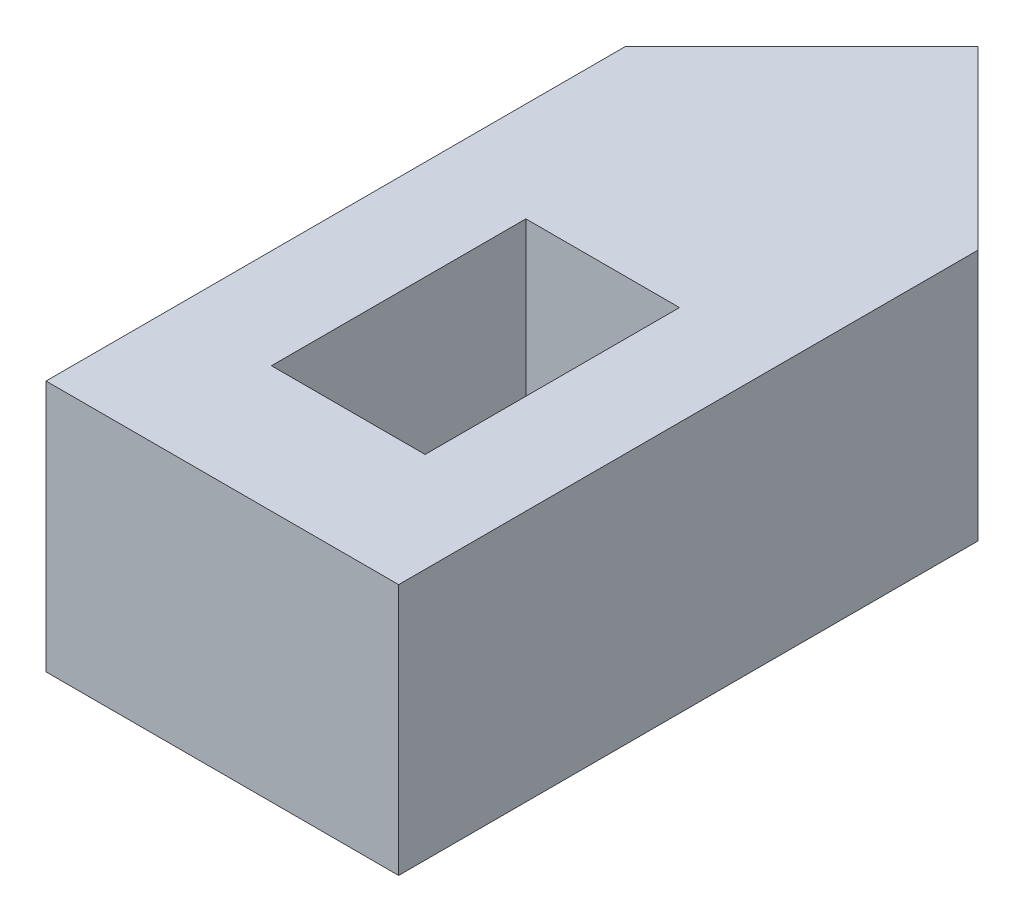
ISO-10303-21;
HEADER;
FILE_DESCRIPTION(('STEP AP214'),'2;1');
FILE_NAME('part.step','',(''),(''),'','','');
FILE_SCHEMA(('AUTOMOTIVE_DESIGN { 1 0 10303 214 1 1 1 1 }'));
ENDSEC;
DATA;
#1=APPLICATION_CONTEXT('core data for automotive mechanical design processes');
#2=APPLICATION_PROTOCOL_DEFINITION('international standard','automotive_design',2000,#1);
#3=PRODUCT_CONTEXT('',#1,'mechanical');
#4=PRODUCT('Part','Part','',(#3));
#5=PRODUCT_RELATED_PRODUCT_CATEGORY('part','',(#4));
#6=PRODUCT_DEFINITION_FORMATION('','',#4);
#7=PRODUCT_DEFINITION_CONTEXT('part definition',#1,'design');
#8=PRODUCT_DEFINITION('design','',#6,#7);
#9=PRODUCT_DEFINITION_SHAPE('','',#8);
#10=(LENGTH_UNIT() NAMED_UNIT(*) SI_UNIT(.MILLI.,.METRE.));
#11=(NAMED_UNIT(*) PLANE_ANGLE_UNIT() SI_UNIT($,.RADIAN.));
#12=(NAMED_UNIT(*) SI_UNIT($,.STERADIAN.) SOLID_ANGLE_UNIT());
#13=UNCERTAINTY_MEASURE_WITH_UNIT(LENGTH_MEASURE(1.E-05),#10,'distance_accuracy_value','');
#14=(GEOMETRIC_REPRESENTATION_CONTEXT(3) GLOBAL_UNCERTAINTY_ASSIGNED_CONTEXT((#13)) GLOBAL_UNIT_ASSIGNED_CONTEXT((#10,
#11,#12)) REPRESENTATION_CONTEXT('',''));
#15=CARTESIAN_POINT('',(0.,0.,0.));
#16=DIRECTION('',(0.,0.,1.));
#17=DIRECTION('',(1.,0.,0.));
#18=AXIS2_PLACEMENT_3D('',#15,#16,#17);
#19=CARTESIAN_POINT('',(0.,5.,0.));
#20=DIRECTION('',(0.,-1.,0.));
#21=DIRECTION('',(0.,0.,-1.));
#22=AXIS2_PLACEMENT_3D('',#19,#20,#21);
#23=PLANE('',#22);
#24=DIRECTION('',(0.707106781186546,0.,0.707106781186549));
#25=VECTOR('',#24,1.);
#26=CARTESIAN_POINT('',(3.5,5.,-15.));
#27=LINE('',#26,#25);
#28=CARTESIAN_POINT('',(7.,5.,-11.5));
#29=VERTEX_POINT('',#28);
#30=CARTESIAN_POINT('',(3.5,5.,-15.));
#31=VERTEX_POINT('',#30);
#32=EDGE_CURVE('E59',#29,#31,#27,.F.);
#33=ORIENTED_EDGE('',*,*,#32,.T.);
#34=DIRECTION('',(0.707106781186549,0.,-0.707106781186546));
#35=VECTOR('',#34,1.);
#36=CARTESIAN_POINT('',(0.,5.,-11.5));
#37=LINE('',#36,#35);
#38=CARTESIAN_POINT('',(0.,5.,-11.5));
#39=VERTEX_POINT('',#38);
#40=EDGE_CURVE('E52',#31,#39,#37,.F.);
#41=ORIENTED_EDGE('',*,*,#40,.T.);
#42=DIRECTION('',(0.,0.,1.));
#43=VECTOR('',#42,1.);
#44=CARTESIAN_POINT('',(0.,5.,0.));
#45=LINE('',#44,#43);
#46=CARTESIAN_POINT('',(0.,5.,0.));
#47=VERTEX_POINT('',#46);
#48=EDGE_CURVE('E169',#39,#47,#45,.T.);
#49=ORIENTED_EDGE('',*,*,#48,.T.);
#50=DIRECTION('',(1.,0.,0.));
#51=VECTOR('',#50,1.);
#52=CARTESIAN_POINT('',(0.,5.,0.));
#53=LINE('',#52,#51);
#54=CARTESIAN_POINT('',(7.,5.,0.));
#55=VERTEX_POINT('',#54);
#56=EDGE_CURVE('E172',#47,#55,#53,.T.);
#57=ORIENTED_EDGE('',*,*,#56,.T.);
#58=DIRECTION('',(0.,0.,-1.));
#59=VECTOR('',#58,1.);
#60=CARTESIAN_POINT('',(7.,5.,0.));
#61=LINE('',#60,#59);
#62=EDGE_CURVE('E176',#55,#29,#61,.T.);
#63=ORIENTED_EDGE('',*,*,#62,.T.);
#64=EDGE_LOOP('',(#33,#41,#49,#57,#63));
#65=FACE_BOUND('',#64,.T.);
#66=DIRECTION('',(0.,0.,1.));
#67=VECTOR('',#66,1.);
#68=CARTESIAN_POINT('',(1.975,5.,-2.5));
#69=LINE('',#68,#67);
#70=CARTESIAN_POINT('',(1.975,5.,-7.55));
#71=VERTEX_POINT('',#70);
#72=CARTESIAN_POINT('',(1.975,5.,-2.5));
#73=VERTEX_POINT('',#72);
#74=EDGE_CURVE('E116',#71,#73,#69,.T.);
#75=ORIENTED_EDGE('',*,*,#74,.F.);
#76=DIRECTION('',(-1.,0.,0.));
#77=VECTOR('',#76,1.);
#78=CARTESIAN_POINT('',(1.975,5.,-7.55));
#79=LINE('',#78,#77);
#80=CARTESIAN_POINT('',(5.025,5.,-7.55));
#81=VERTEX_POINT('',#80);
#82=EDGE_CURVE('E145',#81,#71,#79,.T.);
#83=ORIENTED_EDGE('',*,*,#82,.F.);
#84=DIRECTION('',(0.,0.,-1.));
#85=VECTOR('',#84,1.);
#86=CARTESIAN_POINT('',(5.025,5.,-2.5));
#87=LINE('',#86,#85);
#88=CARTESIAN_POINT('',(5.025,5.,-2.5));
#89=VERTEX_POINT('',#88);
#90=EDGE_CURVE('E141',#89,#81,#87,.T.);
#91=ORIENTED_EDGE('',*,*,#90,.F.);
#92=DIRECTION('',(1.,0.,0.));
#93=VECTOR('',#92,1.);
#94=CARTESIAN_POINT('',(1.975,5.,-2.5));
#95=LINE('',#94,#93);
#96=EDGE_CURVE('E127',#73,#89,#95,.T.);
#97=ORIENTED_EDGE('',*,*,#96,.F.);
#98=EDGE_LOOP('',(#75,#83,#91,#97));
#99=FACE_BOUND('',#98,.T.);
#100=ADVANCED_FACE('F41',(#65,#99),#23,.F.);
#101=CARTESIAN_POINT('',(0.,0.,0.));
#102=DIRECTION('',(0.,-1.,0.));
#103=DIRECTION('',(0.,0.,-1.));
#104=AXIS2_PLACEMENT_3D('',#101,#102,#103);
#105=PLANE('',#104);
#106=DIRECTION('',(0.,0.,1.));
#107=VECTOR('',#106,1.);
#108=CARTESIAN_POINT('',(0.,0.,0.));
#109=LINE('',#108,#107);
#110=CARTESIAN_POINT('',(0.,0.,-11.5));
#111=VERTEX_POINT('',#110);
#112=CARTESIAN_POINT('',(0.,0.,0.));
#113=VERTEX_POINT('',#112);
#114=EDGE_CURVE('E136',#111,#113,#109,.T.);
#115=ORIENTED_EDGE('',*,*,#114,.F.);
#116=DIRECTION('',(-0.707106781186549,0.,0.707106781186546));
#117=VECTOR('',#116,1.);
#118=CARTESIAN_POINT('',(-5.75,0.,-5.75000000000002));
#119=LINE('',#118,#117);
#120=CARTESIAN_POINT('',(3.5,0.,-15.));
#121=VERTEX_POINT('',#120);
#122=EDGE_CURVE('E201',#111,#121,#119,.F.);
#123=ORIENTED_EDGE('',*,*,#122,.T.);
#124=DIRECTION('',(-0.707106781186546,0.,-0.707106781186549));
#125=VECTOR('',#124,1.);
#126=CARTESIAN_POINT('',(9.25000000000001,0.,-9.24999999999998));
#127=LINE('',#126,#125);
#128=CARTESIAN_POINT('',(7.,0.,-11.5));
#129=VERTEX_POINT('',#128);
#130=EDGE_CURVE('E198',#121,#129,#127,.F.);
#131=ORIENTED_EDGE('',*,*,#130,.T.);
#132=DIRECTION('',(0.,0.,-1.));
#133=VECTOR('',#132,1.);
#134=CARTESIAN_POINT('',(7.,0.,0.));
#135=LINE('',#134,#133);
#136=CARTESIAN_POINT('',(7.,0.,0.));
#137=VERTEX_POINT('',#136);
#138=EDGE_CURVE('E173',#137,#129,#135,.T.);
#139=ORIENTED_EDGE('',*,*,#138,.F.);
#140=DIRECTION('',(1.,0.,0.));
#141=VECTOR('',#140,1.);
#142=CARTESIAN_POINT('',(0.,0.,0.));
#143=LINE('',#142,#141);
#144=EDGE_CURVE('E182',#113,#137,#143,.T.);
#145=ORIENTED_EDGE('',*,*,#144,.F.);
#146=EDGE_LOOP('',(#115,#123,#131,#139,#145));
#147=FACE_BOUND('',#146,.T.);
#148=DIRECTION('',(-1.,0.,0.));
#149=VECTOR('',#148,1.);
#150=CARTESIAN_POINT('',(1.975,0.,-7.55));
#151=LINE('',#150,#149);
#152=CARTESIAN_POINT('',(5.025,0.,-7.55));
#153=VERTEX_POINT('',#152);
#154=CARTESIAN_POINT('',(1.975,0.,-7.55));
#155=VERTEX_POINT('',#154);
#156=EDGE_CURVE('E128',#153,#155,#151,.T.);
#157=ORIENTED_EDGE('',*,*,#156,.T.);
#158=DIRECTION('',(0.,0.,1.));
#159=VECTOR('',#158,1.);
#160=CARTESIAN_POINT('',(1.975,0.,-2.5));
#161=LINE('',#160,#159);
#162=CARTESIAN_POINT('',(1.975,0.,-2.5));
#163=VERTEX_POINT('',#162);
#164=EDGE_CURVE('E150',#155,#163,#161,.T.);
#165=ORIENTED_EDGE('',*,*,#164,.T.);
#166=DIRECTION('',(1.,0.,0.));
#167=VECTOR('',#166,1.);
#168=CARTESIAN_POINT('',(1.975,0.,-2.5));
#169=LINE('',#168,#167);
#170=CARTESIAN_POINT('',(5.025,0.,-2.5));
#171=VERTEX_POINT('',#170);
#172=EDGE_CURVE('E134',#163,#171,#169,.T.);
#173=ORIENTED_EDGE('',*,*,#172,.T.);
#174=DIRECTION('',(0.,0.,-1.));
#175=VECTOR('',#174,1.);
#176=CARTESIAN_POINT('',(5.025,0.,-2.5));
#177=LINE('',#176,#175);
#178=EDGE_CURVE('E155',#171,#153,#177,.T.);
#179=ORIENTED_EDGE('',*,*,#178,.T.);
#180=EDGE_LOOP('',(#157,#165,#173,#179));
#181=FACE_BOUND('',#180,.T.);
#182=ADVANCED_FACE('F220',(#147,#181),#105,.T.);
#183=CARTESIAN_POINT('',(0.,5.,0.));
#184=DIRECTION('',(1.,0.,0.));
#185=DIRECTION('',(0.,0.,-1.));
#186=AXIS2_PLACEMENT_3D('',#183,#184,#185);
#187=PLANE('',#186);
#188=ORIENTED_EDGE('',*,*,#48,.F.);
#189=DIRECTION('',(0.,-1.,0.));
#190=VECTOR('',#189,1.);
#191=CARTESIAN_POINT('',(0.,5.,-11.5));
#192=LINE('',#191,#190);
#193=EDGE_CURVE('E194',#39,#111,#192,.T.);
#194=ORIENTED_EDGE('',*,*,#193,.T.);
#195=ORIENTED_EDGE('',*,*,#114,.T.);
#196=DIRECTION('',(0.,-1.,0.));
#197=VECTOR('',#196,1.);
#198=CARTESIAN_POINT('',(0.,5.,0.));
#199=LINE('',#198,#197);
#200=EDGE_CURVE('E190',#47,#113,#199,.T.);
#201=ORIENTED_EDGE('',*,*,#200,.F.);
#202=EDGE_LOOP('',(#188,#194,#195,#201));
#203=FACE_BOUND('',#202,.T.);
#204=ADVANCED_FACE('F215',(#203),#187,.F.);
#205=CARTESIAN_POINT('',(0.,5.,0.));
#206=DIRECTION('',(0.,0.,-1.));
#207=DIRECTION('',(-1.,0.,0.));
#208=AXIS2_PLACEMENT_3D('',#205,#206,#207);
#209=PLANE('',#208);
#210=ORIENTED_EDGE('',*,*,#144,.T.);
#211=DIRECTION('',(0.,-1.,0.));
#212=VECTOR('',#211,1.);
#213=CARTESIAN_POINT('',(7.,5.,0.));
#214=LINE('',#213,#212);
#215=EDGE_CURVE('E179',#55,#137,#214,.T.);
#216=ORIENTED_EDGE('',*,*,#215,.F.);
#217=ORIENTED_EDGE('',*,*,#56,.F.);
#218=ORIENTED_EDGE('',*,*,#200,.T.);
#219=EDGE_LOOP('',(#210,#216,#217,#218));
#220=FACE_BOUND('',#219,.T.);
#221=ADVANCED_FACE('F247',(#220),#209,.F.);
#222=CARTESIAN_POINT('',(7.,5.,0.));
#223=DIRECTION('',(-1.,0.,0.));
#224=DIRECTION('',(0.,0.,1.));
#225=AXIS2_PLACEMENT_3D('',#222,#223,#224);
#226=PLANE('',#225);
#227=ORIENTED_EDGE('',*,*,#138,.T.);
#228=DIRECTION('',(0.,1.,0.));
#229=VECTOR('',#228,1.);
#230=CARTESIAN_POINT('',(7.,5.,-11.5));
#231=LINE('',#230,#229);
#232=EDGE_CURVE('E11',#129,#29,#231,.T.);
#233=ORIENTED_EDGE('',*,*,#232,.T.);
#234=ORIENTED_EDGE('',*,*,#62,.F.);
#235=ORIENTED_EDGE('',*,*,#215,.T.);
#236=EDGE_LOOP('',(#227,#233,#234,#235));
#237=FACE_BOUND('',#236,.T.);
#238=ADVANCED_FACE('F244',(#237),#226,.F.);
#239=CARTESIAN_POINT('',(1.975,5.,-2.5));
#240=DIRECTION('',(1.,0.,0.));
#241=DIRECTION('',(0.,0.,-1.));
#242=AXIS2_PLACEMENT_3D('',#239,#240,#241);
#243=PLANE('',#242);
#244=ORIENTED_EDGE('',*,*,#164,.F.);
#245=DIRECTION('',(0.,-1.,0.));
#246=VECTOR('',#245,1.);
#247=CARTESIAN_POINT('',(1.975,5.,-7.55));
#248=LINE('',#247,#246);
#249=EDGE_CURVE('E122',#71,#155,#248,.T.);
#250=ORIENTED_EDGE('',*,*,#249,.F.);
#251=ORIENTED_EDGE('',*,*,#74,.T.);
#252=DIRECTION('',(0.,-1.,0.));
#253=VECTOR('',#252,1.);
#254=CARTESIAN_POINT('',(1.975,5.,-2.5));
#255=LINE('',#254,#253);
#256=EDGE_CURVE('E119',#73,#163,#255,.T.);
#257=ORIENTED_EDGE('',*,*,#256,.T.);
#258=EDGE_LOOP('',(#244,#250,#251,#257));
#259=FACE_BOUND('',#258,.T.);
#260=ADVANCED_FACE('F118',(#259),#243,.T.);
#261=CARTESIAN_POINT('',(1.975,5.,-2.5));
#262=DIRECTION('',(0.,0.,-1.));
#263=DIRECTION('',(-1.,0.,0.));
#264=AXIS2_PLACEMENT_3D('',#261,#262,#263);
#265=PLANE('',#264);
#266=ORIENTED_EDGE('',*,*,#172,.F.);
#267=ORIENTED_EDGE('',*,*,#256,.F.);
#268=ORIENTED_EDGE('',*,*,#96,.T.);
#269=DIRECTION('',(0.,-1.,0.));
#270=VECTOR('',#269,1.);
#271=CARTESIAN_POINT('',(5.025,5.,-2.5));
#272=LINE('',#271,#270);
#273=EDGE_CURVE('E137',#89,#171,#272,.T.);
#274=ORIENTED_EDGE('',*,*,#273,.T.);
#275=EDGE_LOOP('',(#266,#267,#268,#274));
#276=FACE_BOUND('',#275,.T.);
#277=ADVANCED_FACE('F131',(#276),#265,.T.);
#278=CARTESIAN_POINT('',(5.025,5.,-2.5));
#279=DIRECTION('',(-1.,0.,0.));
#280=DIRECTION('',(0.,0.,1.));
#281=AXIS2_PLACEMENT_3D('',#278,#279,#280);
#282=PLANE('',#281);
#283=ORIENTED_EDGE('',*,*,#178,.F.);
#284=ORIENTED_EDGE('',*,*,#273,.F.);
#285=ORIENTED_EDGE('',*,*,#90,.T.);
#286=DIRECTION('',(0.,-1.,0.));
#287=VECTOR('',#286,1.);
#288=CARTESIAN_POINT('',(5.025,5.,-7.55));
#289=LINE('',#288,#287);
#290=EDGE_CURVE('E164',#81,#153,#289,.T.);
#291=ORIENTED_EDGE('',*,*,#290,.T.);
#292=EDGE_LOOP('',(#283,#284,#285,#291));
#293=FACE_BOUND('',#292,.T.);
#294=ADVANCED_FACE('F232',(#293),#282,.T.);
#295=CARTESIAN_POINT('',(1.975,5.,-7.55));
#296=DIRECTION('',(0.,0.,1.));
#297=DIRECTION('',(1.,0.,0.));
#298=AXIS2_PLACEMENT_3D('',#295,#296,#297);
#299=PLANE('',#298);
#300=ORIENTED_EDGE('',*,*,#156,.F.);
#301=ORIENTED_EDGE('',*,*,#290,.F.);
#302=ORIENTED_EDGE('',*,*,#82,.T.);
#303=ORIENTED_EDGE('',*,*,#249,.T.);
#304=EDGE_LOOP('',(#300,#301,#302,#303));
#305=FACE_BOUND('',#304,.T.);
#306=ADVANCED_FACE('F227',(#305),#299,.T.);
#307=CARTESIAN_POINT('',(3.5,5.,-15.));
#308=DIRECTION('',(-0.707106781186549,0.,0.707106781186546));
#309=DIRECTION('',(0.,-1.,0.));
#310=AXIS2_PLACEMENT_3D('',#307,#308,#309);
#311=PLANE('',#310);
#312=DIRECTION('',(0.,-1.,0.));
#313=VECTOR('',#312,1.);
#314=CARTESIAN_POINT('',(3.5,5.,-15.));
#315=LINE('',#314,#313);
#316=EDGE_CURVE('E46',#31,#121,#315,.T.);
#317=ORIENTED_EDGE('',*,*,#316,.F.);
#318=ORIENTED_EDGE('',*,*,#32,.F.);
#319=ORIENTED_EDGE('',*,*,#232,.F.);
#320=ORIENTED_EDGE('',*,*,#130,.F.);
#321=EDGE_LOOP('',(#317,#318,#319,#320));
#322=FACE_BOUND('',#321,.T.);
#323=ADVANCED_FACE('F44',(#322),#311,.F.);
#324=CARTESIAN_POINT('',(0.,5.,-11.5));
#325=DIRECTION('',(0.707106781186546,0.,0.707106781186549));
#326=DIRECTION('',(0.,-1.,0.));
#327=AXIS2_PLACEMENT_3D('',#324,#325,#326);
#328=PLANE('',#327);
#329=ORIENTED_EDGE('',*,*,#40,.F.);
#330=ORIENTED_EDGE('',*,*,#316,.T.);
#331=ORIENTED_EDGE('',*,*,#122,.F.);
#332=ORIENTED_EDGE('',*,*,#193,.F.);
#333=EDGE_LOOP('',(#329,#330,#331,#332));
#334=FACE_BOUND('',#333,.T.);
#335=ADVANCED_FACE('F217',(#334),#328,.F.);
#336=CLOSED_SHELL('',(#100,#182,#204,#221,#238,#260,#277,#294,#306,#323,#335));
#337=MANIFOLD_SOLID_BREP('B2',#336);
#338=ADVANCED_BREP_SHAPE_REPRESENTATION('',(#18,#337),#14);
#339=SHAPE_DEFINITION_REPRESENTATION(#9,#338);
ENDSEC;
END-ISO-10303-21;
